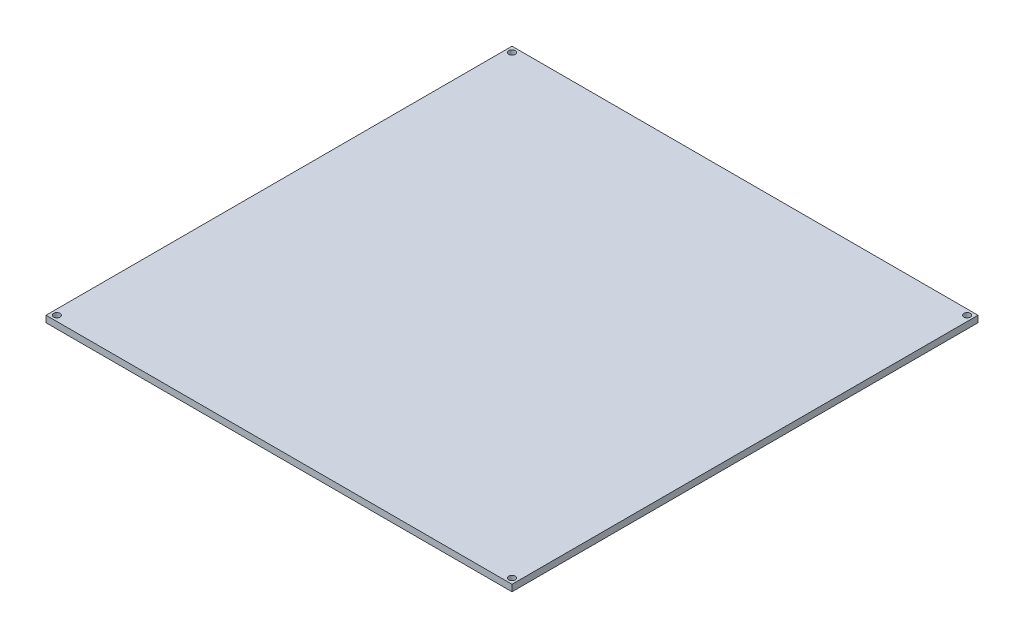
ISO-10303-21;
HEADER;
FILE_DESCRIPTION(('STEP AP214'),'2;1');
FILE_NAME('part.step','',(''),(''),'','','');
FILE_SCHEMA(('AUTOMOTIVE_DESIGN { 1 0 10303 214 1 1 1 1 }'));
ENDSEC;
DATA;
#1=APPLICATION_CONTEXT('core data for automotive mechanical design processes');
#2=APPLICATION_PROTOCOL_DEFINITION('international standard','automotive_design',2000,#1);
#3=PRODUCT_CONTEXT('',#1,'mechanical');
#4=PRODUCT('Part','Part','',(#3));
#5=PRODUCT_RELATED_PRODUCT_CATEGORY('part','',(#4));
#6=PRODUCT_DEFINITION_FORMATION('','',#4);
#7=PRODUCT_DEFINITION_CONTEXT('part definition',#1,'design');
#8=PRODUCT_DEFINITION('design','',#6,#7);
#9=PRODUCT_DEFINITION_SHAPE('','',#8);
#10=(LENGTH_UNIT() NAMED_UNIT(*) SI_UNIT(.MILLI.,.METRE.));
#11=(NAMED_UNIT(*) PLANE_ANGLE_UNIT() SI_UNIT($,.RADIAN.));
#12=(NAMED_UNIT(*) SI_UNIT($,.STERADIAN.) SOLID_ANGLE_UNIT());
#13=UNCERTAINTY_MEASURE_WITH_UNIT(LENGTH_MEASURE(1.E-05),#10,'distance_accuracy_value','');
#14=(GEOMETRIC_REPRESENTATION_CONTEXT(3) GLOBAL_UNCERTAINTY_ASSIGNED_CONTEXT((#13)) GLOBAL_UNIT_ASSIGNED_CONTEXT((#10,
#11,#12)) REPRESENTATION_CONTEXT('',''));
#15=CARTESIAN_POINT('',(0.,0.,0.));
#16=DIRECTION('',(0.,0.,1.));
#17=DIRECTION('',(1.,0.,0.));
#18=AXIS2_PLACEMENT_3D('',#15,#16,#17);
#19=CARTESIAN_POINT('',(0.,3.,0.));
#20=DIRECTION('',(1.,0.,0.));
#21=DIRECTION('',(0.,0.,-1.));
#22=AXIS2_PLACEMENT_3D('',#19,#20,#21);
#23=PLANE('',#22);
#24=DIRECTION('',(0.,0.,1.));
#25=VECTOR('',#24,1.);
#26=CARTESIAN_POINT('',(0.,0.,0.));
#27=LINE('',#26,#25);
#28=CARTESIAN_POINT('',(0.,0.,-214.));
#29=VERTEX_POINT('',#28);
#30=CARTESIAN_POINT('',(0.,0.,0.));
#31=VERTEX_POINT('',#30);
#32=EDGE_CURVE('E96',#29,#31,#27,.T.);
#33=ORIENTED_EDGE('',*,*,#32,.T.);
#34=DIRECTION('',(0.,-1.,0.));
#35=VECTOR('',#34,1.);
#36=CARTESIAN_POINT('',(0.,3.,0.));
#37=LINE('',#36,#35);
#38=CARTESIAN_POINT('',(0.,3.,0.));
#39=VERTEX_POINT('',#38);
#40=EDGE_CURVE('E11',#39,#31,#37,.T.);
#41=ORIENTED_EDGE('',*,*,#40,.F.);
#42=DIRECTION('',(0.,0.,1.));
#43=VECTOR('',#42,1.);
#44=CARTESIAN_POINT('',(0.,3.,0.));
#45=LINE('',#44,#43);
#46=CARTESIAN_POINT('',(0.,3.,-214.));
#47=VERTEX_POINT('',#46);
#48=EDGE_CURVE('E84',#47,#39,#45,.T.);
#49=ORIENTED_EDGE('',*,*,#48,.F.);
#50=DIRECTION('',(0.,-1.,0.));
#51=VECTOR('',#50,1.);
#52=CARTESIAN_POINT('',(0.,3.,-214.));
#53=LINE('',#52,#51);
#54=EDGE_CURVE('E92',#47,#29,#53,.T.);
#55=ORIENTED_EDGE('',*,*,#54,.T.);
#56=EDGE_LOOP('',(#33,#41,#49,#55));
#57=FACE_BOUND('',#56,.T.);
#58=ADVANCED_FACE('F33',(#57),#23,.F.);
#59=CARTESIAN_POINT('',(0.,3.,0.));
#60=DIRECTION('',(0.,0.,-1.));
#61=DIRECTION('',(-1.,0.,0.));
#62=AXIS2_PLACEMENT_3D('',#59,#60,#61);
#63=PLANE('',#62);
#64=DIRECTION('',(1.,0.,0.));
#65=VECTOR('',#64,1.);
#66=CARTESIAN_POINT('',(0.,0.,0.));
#67=LINE('',#66,#65);
#68=CARTESIAN_POINT('',(214.,0.,0.));
#69=VERTEX_POINT('',#68);
#70=EDGE_CURVE('E88',#31,#69,#67,.T.);
#71=ORIENTED_EDGE('',*,*,#70,.T.);
#72=DIRECTION('',(0.,-1.,0.));
#73=VECTOR('',#72,1.);
#74=CARTESIAN_POINT('',(214.,3.,0.));
#75=LINE('',#74,#73);
#76=CARTESIAN_POINT('',(214.,3.,0.));
#77=VERTEX_POINT('',#76);
#78=EDGE_CURVE('E41',#77,#69,#75,.T.);
#79=ORIENTED_EDGE('',*,*,#78,.F.);
#80=DIRECTION('',(1.,0.,0.));
#81=VECTOR('',#80,1.);
#82=CARTESIAN_POINT('',(0.,3.,0.));
#83=LINE('',#82,#81);
#84=EDGE_CURVE('E79',#39,#77,#83,.T.);
#85=ORIENTED_EDGE('',*,*,#84,.F.);
#86=ORIENTED_EDGE('',*,*,#40,.T.);
#87=EDGE_LOOP('',(#71,#79,#85,#86));
#88=FACE_BOUND('',#87,.T.);
#89=ADVANCED_FACE('F87',(#88),#63,.F.);
#90=CARTESIAN_POINT('',(214.,3.,0.));
#91=DIRECTION('',(-1.,0.,0.));
#92=DIRECTION('',(0.,0.,1.));
#93=AXIS2_PLACEMENT_3D('',#90,#91,#92);
#94=PLANE('',#93);
#95=DIRECTION('',(0.,0.,-1.));
#96=VECTOR('',#95,1.);
#97=CARTESIAN_POINT('',(214.,0.,0.));
#98=LINE('',#97,#96);
#99=CARTESIAN_POINT('',(214.,0.,-214.));
#100=VERTEX_POINT('',#99);
#101=EDGE_CURVE('E66',#69,#100,#98,.T.);
#102=ORIENTED_EDGE('',*,*,#101,.T.);
#103=DIRECTION('',(0.,-1.,0.));
#104=VECTOR('',#103,1.);
#105=CARTESIAN_POINT('',(214.,3.,-214.));
#106=LINE('',#105,#104);
#107=CARTESIAN_POINT('',(214.,3.,-214.));
#108=VERTEX_POINT('',#107);
#109=EDGE_CURVE('E89',#108,#100,#106,.T.);
#110=ORIENTED_EDGE('',*,*,#109,.F.);
#111=DIRECTION('',(0.,0.,-1.));
#112=VECTOR('',#111,1.);
#113=CARTESIAN_POINT('',(214.,3.,0.));
#114=LINE('',#113,#112);
#115=EDGE_CURVE('E82',#77,#108,#114,.T.);
#116=ORIENTED_EDGE('',*,*,#115,.F.);
#117=ORIENTED_EDGE('',*,*,#78,.T.);
#118=EDGE_LOOP('',(#102,#110,#116,#117));
#119=FACE_BOUND('',#118,.T.);
#120=ADVANCED_FACE('F90',(#119),#94,.F.);
#121=CARTESIAN_POINT('',(0.,3.,-214.));
#122=DIRECTION('',(0.,0.,1.));
#123=DIRECTION('',(1.,0.,0.));
#124=AXIS2_PLACEMENT_3D('',#121,#122,#123);
#125=PLANE('',#124);
#126=DIRECTION('',(-1.,0.,0.));
#127=VECTOR('',#126,1.);
#128=CARTESIAN_POINT('',(0.,0.,-214.));
#129=LINE('',#128,#127);
#130=EDGE_CURVE('E72',#100,#29,#129,.T.);
#131=ORIENTED_EDGE('',*,*,#130,.T.);
#132=ORIENTED_EDGE('',*,*,#54,.F.);
#133=DIRECTION('',(-1.,0.,0.));
#134=VECTOR('',#133,1.);
#135=CARTESIAN_POINT('',(0.,3.,-214.));
#136=LINE('',#135,#134);
#137=EDGE_CURVE('E49',#108,#47,#136,.T.);
#138=ORIENTED_EDGE('',*,*,#137,.F.);
#139=ORIENTED_EDGE('',*,*,#109,.T.);
#140=EDGE_LOOP('',(#131,#132,#138,#139));
#141=FACE_BOUND('',#140,.T.);
#142=ADVANCED_FACE('F104',(#141),#125,.F.);
#143=CARTESIAN_POINT('',(0.,3.,0.));
#144=DIRECTION('',(0.,-1.,0.));
#145=DIRECTION('',(0.,0.,-1.));
#146=AXIS2_PLACEMENT_3D('',#143,#144,#145);
#147=PLANE('',#146);
#148=CARTESIAN_POINT('',(2.5,3.,-2.5));
#149=DIRECTION('',(0.,1.,0.));
#150=DIRECTION('',(0.,0.,1.));
#151=AXIS2_PLACEMENT_3D('',#148,#149,#150);
#152=CIRCLE('',#151,1.5);
#153=CARTESIAN_POINT('',(2.5,3.,-0.999999999999998));
#154=VERTEX_POINT('',#153);
#155=EDGE_CURVE('E128',#154,#154,#152,.T.);
#156=ORIENTED_EDGE('',*,*,#155,.F.);
#157=EDGE_LOOP('',(#156));
#158=FACE_BOUND('',#157,.T.);
#159=CARTESIAN_POINT('',(211.5,3.,-2.5));
#160=DIRECTION('',(0.,1.,0.));
#161=DIRECTION('',(0.,0.,1.));
#162=AXIS2_PLACEMENT_3D('',#159,#160,#161);
#163=CIRCLE('',#162,1.50000000000003);
#164=CARTESIAN_POINT('',(211.5,3.,-0.999999999999976));
#165=VERTEX_POINT('',#164);
#166=EDGE_CURVE('E122',#165,#165,#163,.T.);
#167=ORIENTED_EDGE('',*,*,#166,.F.);
#168=EDGE_LOOP('',(#167));
#169=FACE_BOUND('',#168,.T.);
#170=CARTESIAN_POINT('',(211.5,3.,-211.5));
#171=DIRECTION('',(0.,1.,0.));
#172=DIRECTION('',(0.,0.,1.));
#173=AXIS2_PLACEMENT_3D('',#170,#171,#172);
#174=CIRCLE('',#173,1.50000000000002);
#175=CARTESIAN_POINT('',(211.5,3.,-210.));
#176=VERTEX_POINT('',#175);
#177=EDGE_CURVE('E116',#176,#176,#174,.T.);
#178=ORIENTED_EDGE('',*,*,#177,.F.);
#179=EDGE_LOOP('',(#178));
#180=FACE_BOUND('',#179,.T.);
#181=CARTESIAN_POINT('',(2.5,3.,-211.5));
#182=DIRECTION('',(0.,1.,0.));
#183=DIRECTION('',(0.,0.,1.));
#184=AXIS2_PLACEMENT_3D('',#181,#182,#183);
#185=CIRCLE('',#184,1.5);
#186=CARTESIAN_POINT('',(2.5,3.,-210.));
#187=VERTEX_POINT('',#186);
#188=EDGE_CURVE('E110',#187,#187,#185,.T.);
#189=ORIENTED_EDGE('',*,*,#188,.F.);
#190=EDGE_LOOP('',(#189));
#191=FACE_BOUND('',#190,.T.);
#192=ORIENTED_EDGE('',*,*,#48,.T.);
#193=ORIENTED_EDGE('',*,*,#84,.T.);
#194=ORIENTED_EDGE('',*,*,#115,.T.);
#195=ORIENTED_EDGE('',*,*,#137,.T.);
#196=EDGE_LOOP('',(#192,#193,#194,#195));
#197=FACE_BOUND('',#196,.T.);
#198=ADVANCED_FACE('F80',(#158,#169,#180,#191,#197),#147,.F.);
#199=CARTESIAN_POINT('',(0.,0.,0.));
#200=DIRECTION('',(0.,-1.,0.));
#201=DIRECTION('',(0.,0.,-1.));
#202=AXIS2_PLACEMENT_3D('',#199,#200,#201);
#203=PLANE('',#202);
#204=CARTESIAN_POINT('',(2.5,0.,-2.5));
#205=DIRECTION('',(0.,1.,0.));
#206=DIRECTION('',(0.,0.,1.));
#207=AXIS2_PLACEMENT_3D('',#204,#205,#206);
#208=CIRCLE('',#207,1.5);
#209=CARTESIAN_POINT('',(2.5,0.,-0.999999999999998));
#210=VERTEX_POINT('',#209);
#211=EDGE_CURVE('E113',#210,#210,#208,.T.);
#212=ORIENTED_EDGE('',*,*,#211,.T.);
#213=EDGE_LOOP('',(#212));
#214=FACE_BOUND('',#213,.T.);
#215=CARTESIAN_POINT('',(211.5,0.,-2.5));
#216=DIRECTION('',(0.,1.,0.));
#217=DIRECTION('',(0.,0.,1.));
#218=AXIS2_PLACEMENT_3D('',#215,#216,#217);
#219=CIRCLE('',#218,1.50000000000003);
#220=CARTESIAN_POINT('',(211.5,0.,-0.999999999999976));
#221=VERTEX_POINT('',#220);
#222=EDGE_CURVE('E125',#221,#221,#219,.T.);
#223=ORIENTED_EDGE('',*,*,#222,.T.);
#224=EDGE_LOOP('',(#223));
#225=FACE_BOUND('',#224,.T.);
#226=CARTESIAN_POINT('',(211.5,0.,-211.5));
#227=DIRECTION('',(0.,1.,0.));
#228=DIRECTION('',(0.,0.,1.));
#229=AXIS2_PLACEMENT_3D('',#226,#227,#228);
#230=CIRCLE('',#229,1.50000000000002);
#231=CARTESIAN_POINT('',(211.5,0.,-210.));
#232=VERTEX_POINT('',#231);
#233=EDGE_CURVE('E119',#232,#232,#230,.T.);
#234=ORIENTED_EDGE('',*,*,#233,.T.);
#235=EDGE_LOOP('',(#234));
#236=FACE_BOUND('',#235,.T.);
#237=CARTESIAN_POINT('',(2.5,0.,-211.5));
#238=DIRECTION('',(0.,1.,0.));
#239=DIRECTION('',(0.,0.,1.));
#240=AXIS2_PLACEMENT_3D('',#237,#238,#239);
#241=CIRCLE('',#240,1.5);
#242=CARTESIAN_POINT('',(2.5,0.,-210.));
#243=VERTEX_POINT('',#242);
#244=EDGE_CURVE('E99',#243,#243,#241,.T.);
#245=ORIENTED_EDGE('',*,*,#244,.T.);
#246=EDGE_LOOP('',(#245));
#247=FACE_BOUND('',#246,.T.);
#248=ORIENTED_EDGE('',*,*,#32,.F.);
#249=ORIENTED_EDGE('',*,*,#130,.F.);
#250=ORIENTED_EDGE('',*,*,#101,.F.);
#251=ORIENTED_EDGE('',*,*,#70,.F.);
#252=EDGE_LOOP('',(#248,#249,#250,#251));
#253=FACE_BOUND('',#252,.T.);
#254=ADVANCED_FACE('F107',(#214,#225,#236,#247,#253),#203,.T.);
#255=CARTESIAN_POINT('',(2.5,0.,-211.5));
#256=DIRECTION('',(0.,1.,0.));
#257=DIRECTION('',(0.,0.,1.));
#258=AXIS2_PLACEMENT_3D('',#255,#256,#257);
#259=CYLINDRICAL_SURFACE('',#258,1.5);
#260=ORIENTED_EDGE('',*,*,#244,.F.);
#261=EDGE_LOOP('',(#260));
#262=FACE_BOUND('',#261,.T.);
#263=ORIENTED_EDGE('',*,*,#188,.T.);
#264=EDGE_LOOP('',(#263));
#265=FACE_BOUND('',#264,.T.);
#266=ADVANCED_FACE('F152',(#262,#265),#259,.F.);
#267=CARTESIAN_POINT('',(211.5,0.,-211.5));
#268=DIRECTION('',(0.,1.,0.));
#269=DIRECTION('',(0.,0.,1.));
#270=AXIS2_PLACEMENT_3D('',#267,#268,#269);
#271=CYLINDRICAL_SURFACE('',#270,1.50000000000002);
#272=ORIENTED_EDGE('',*,*,#233,.F.);
#273=EDGE_LOOP('',(#272));
#274=FACE_BOUND('',#273,.T.);
#275=ORIENTED_EDGE('',*,*,#177,.T.);
#276=EDGE_LOOP('',(#275));
#277=FACE_BOUND('',#276,.T.);
#278=ADVANCED_FACE('F154',(#274,#277),#271,.F.);
#279=CARTESIAN_POINT('',(211.5,0.,-2.5));
#280=DIRECTION('',(0.,1.,0.));
#281=DIRECTION('',(0.,0.,1.));
#282=AXIS2_PLACEMENT_3D('',#279,#280,#281);
#283=CYLINDRICAL_SURFACE('',#282,1.50000000000003);
#284=ORIENTED_EDGE('',*,*,#222,.F.);
#285=EDGE_LOOP('',(#284));
#286=FACE_BOUND('',#285,.T.);
#287=ORIENTED_EDGE('',*,*,#166,.T.);
#288=EDGE_LOOP('',(#287));
#289=FACE_BOUND('',#288,.T.);
#290=ADVANCED_FACE('F139',(#286,#289),#283,.F.);
#291=CARTESIAN_POINT('',(2.5,0.,-2.5));
#292=DIRECTION('',(0.,1.,0.));
#293=DIRECTION('',(0.,0.,1.));
#294=AXIS2_PLACEMENT_3D('',#291,#292,#293);
#295=CYLINDRICAL_SURFACE('',#294,1.5);
#296=ORIENTED_EDGE('',*,*,#211,.F.);
#297=EDGE_LOOP('',(#296));
#298=FACE_BOUND('',#297,.T.);
#299=ORIENTED_EDGE('',*,*,#155,.T.);
#300=EDGE_LOOP('',(#299));
#301=FACE_BOUND('',#300,.T.);
#302=ADVANCED_FACE('F136',(#298,#301),#295,.F.);
#303=CLOSED_SHELL('',(#58,#89,#120,#142,#198,#254,#266,#278,#290,#302));
#304=MANIFOLD_SOLID_BREP('B2',#303);
#305=ADVANCED_BREP_SHAPE_REPRESENTATION('',(#18,#304),#14);
#306=SHAPE_DEFINITION_REPRESENTATION(#9,#305);
ENDSEC;
END-ISO-10303-21;
